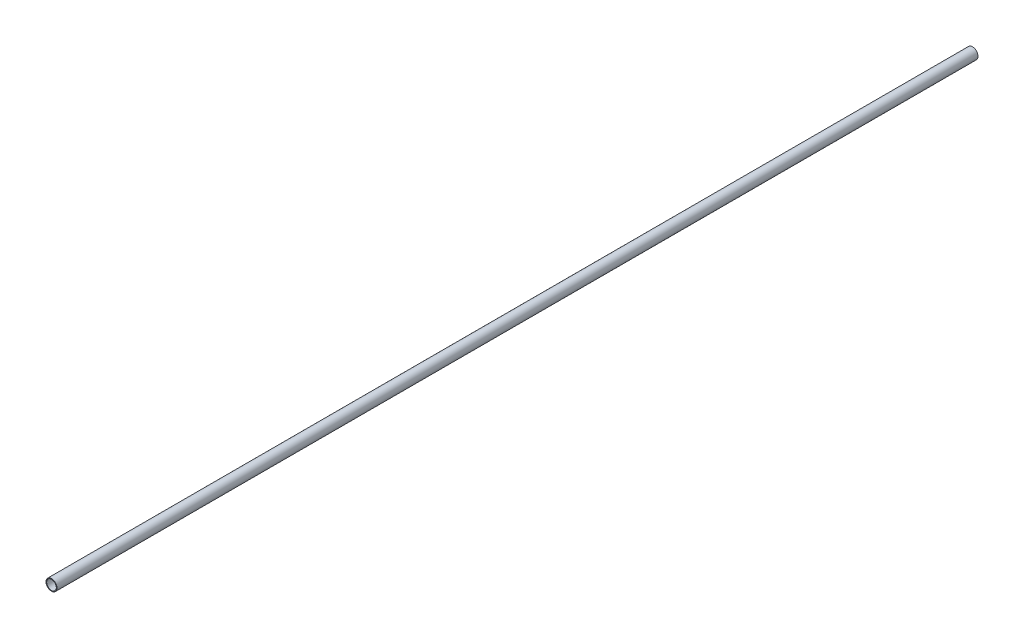
ISO-10303-21;
HEADER;
FILE_DESCRIPTION(('STEP AP214'),'2;1');
FILE_NAME('part.step','',(''),(''),'','','');
FILE_SCHEMA(('AUTOMOTIVE_DESIGN { 1 0 10303 214 1 1 1 1 }'));
ENDSEC;
DATA;
#1=APPLICATION_CONTEXT('core data for automotive mechanical design processes');
#2=APPLICATION_PROTOCOL_DEFINITION('international standard','automotive_design',2000,#1);
#3=PRODUCT_CONTEXT('',#1,'mechanical');
#4=PRODUCT('Part','Part','',(#3));
#5=PRODUCT_RELATED_PRODUCT_CATEGORY('part','',(#4));
#6=PRODUCT_DEFINITION_FORMATION('','',#4);
#7=PRODUCT_DEFINITION_CONTEXT('part definition',#1,'design');
#8=PRODUCT_DEFINITION('design','',#6,#7);
#9=PRODUCT_DEFINITION_SHAPE('','',#8);
#10=(LENGTH_UNIT() NAMED_UNIT(*) SI_UNIT(.MILLI.,.METRE.));
#11=(NAMED_UNIT(*) PLANE_ANGLE_UNIT() SI_UNIT($,.RADIAN.));
#12=(NAMED_UNIT(*) SI_UNIT($,.STERADIAN.) SOLID_ANGLE_UNIT());
#13=UNCERTAINTY_MEASURE_WITH_UNIT(LENGTH_MEASURE(1.E-05),#10,'distance_accuracy_value','');
#14=(GEOMETRIC_REPRESENTATION_CONTEXT(3) GLOBAL_UNCERTAINTY_ASSIGNED_CONTEXT((#13)) GLOBAL_UNIT_ASSIGNED_CONTEXT((#10,
#11,#12)) REPRESENTATION_CONTEXT('',''));
#15=CARTESIAN_POINT('',(0.,0.,0.));
#16=DIRECTION('',(0.,0.,1.));
#17=DIRECTION('',(1.,0.,0.));
#18=AXIS2_PLACEMENT_3D('',#15,#16,#17);
#19=CARTESIAN_POINT('',(0.,0.,914.4));
#20=DIRECTION('',(0.,0.,1.));
#21=DIRECTION('',(1.,0.,0.));
#22=AXIS2_PLACEMENT_3D('',#19,#20,#21);
#23=PLANE('',#22);
#24=CARTESIAN_POINT('',(0.,0.,914.4));
#25=DIRECTION('',(0.,0.,1.));
#26=DIRECTION('',(1.,0.,0.));
#27=AXIS2_PLACEMENT_3D('',#24,#25,#26);
#28=CIRCLE('',#27,10.922);
#29=CARTESIAN_POINT('',(10.922,0.,914.4));
#30=VERTEX_POINT('',#29);
#31=EDGE_CURVE('E10',#30,#30,#28,.T.);
#32=ORIENTED_EDGE('',*,*,#31,.T.);
#33=EDGE_LOOP('',(#32));
#34=FACE_BOUND('',#33,.T.);
#35=CARTESIAN_POINT('',(0.,0.,914.4));
#36=DIRECTION('',(0.,0.,1.));
#37=DIRECTION('',(1.,0.,0.));
#38=AXIS2_PLACEMENT_3D('',#35,#36,#37);
#39=CIRCLE('',#38,9.525);
#40=CARTESIAN_POINT('',(9.525,0.,914.4));
#41=VERTEX_POINT('',#40);
#42=EDGE_CURVE('E44',#41,#41,#39,.T.);
#43=ORIENTED_EDGE('',*,*,#42,.F.);
#44=EDGE_LOOP('',(#43));
#45=FACE_BOUND('',#44,.T.);
#46=ADVANCED_FACE('F37',(#34,#45),#23,.T.);
#47=CARTESIAN_POINT('',(0.,0.,914.4));
#48=DIRECTION('',(0.,0.,-1.));
#49=DIRECTION('',(-1.,0.,0.));
#50=AXIS2_PLACEMENT_3D('',#47,#48,#49);
#51=CYLINDRICAL_SURFACE('',#50,10.922);
#52=ORIENTED_EDGE('',*,*,#31,.F.);
#53=EDGE_LOOP('',(#52));
#54=FACE_BOUND('',#53,.T.);
#55=CARTESIAN_POINT('',(0.,0.,-914.4));
#56=DIRECTION('',(0.,0.,1.));
#57=DIRECTION('',(1.,0.,0.));
#58=AXIS2_PLACEMENT_3D('',#55,#56,#57);
#59=CIRCLE('',#58,10.922);
#60=CARTESIAN_POINT('',(10.922,0.,-914.4));
#61=VERTEX_POINT('',#60);
#62=EDGE_CURVE('E48',#61,#61,#59,.T.);
#63=ORIENTED_EDGE('',*,*,#62,.T.);
#64=EDGE_LOOP('',(#63));
#65=FACE_BOUND('',#64,.T.);
#66=ADVANCED_FACE('F39',(#54,#65),#51,.T.);
#67=CARTESIAN_POINT('',(0.,0.,914.4));
#68=DIRECTION('',(0.,0.,-1.));
#69=DIRECTION('',(-1.,0.,0.));
#70=AXIS2_PLACEMENT_3D('',#67,#68,#69);
#71=CYLINDRICAL_SURFACE('',#70,9.525);
#72=ORIENTED_EDGE('',*,*,#42,.T.);
#73=EDGE_LOOP('',(#72));
#74=FACE_BOUND('',#73,.T.);
#75=CARTESIAN_POINT('',(0.,0.,-914.4));
#76=DIRECTION('',(0.,0.,1.));
#77=DIRECTION('',(1.,0.,0.));
#78=AXIS2_PLACEMENT_3D('',#75,#76,#77);
#79=CIRCLE('',#78,9.525);
#80=CARTESIAN_POINT('',(9.525,0.,-914.4));
#81=VERTEX_POINT('',#80);
#82=EDGE_CURVE('E52',#81,#81,#79,.T.);
#83=ORIENTED_EDGE('',*,*,#82,.F.);
#84=EDGE_LOOP('',(#83));
#85=FACE_BOUND('',#84,.T.);
#86=ADVANCED_FACE('F61',(#74,#85),#71,.F.);
#87=CARTESIAN_POINT('',(0.,0.,-914.4));
#88=DIRECTION('',(0.,0.,1.));
#89=DIRECTION('',(1.,0.,0.));
#90=AXIS2_PLACEMENT_3D('',#87,#88,#89);
#91=PLANE('',#90);
#92=ORIENTED_EDGE('',*,*,#82,.T.);
#93=EDGE_LOOP('',(#92));
#94=FACE_BOUND('',#93,.T.);
#95=ORIENTED_EDGE('',*,*,#62,.F.);
#96=EDGE_LOOP('',(#95));
#97=FACE_BOUND('',#96,.T.);
#98=ADVANCED_FACE('F58',(#94,#97),#91,.F.);
#99=CLOSED_SHELL('',(#46,#66,#86,#98));
#100=MANIFOLD_SOLID_BREP('B2',#99);
#101=ADVANCED_BREP_SHAPE_REPRESENTATION('',(#18,#100),#14);
#102=SHAPE_DEFINITION_REPRESENTATION(#9,#101);
ENDSEC;
END-ISO-10303-21;
